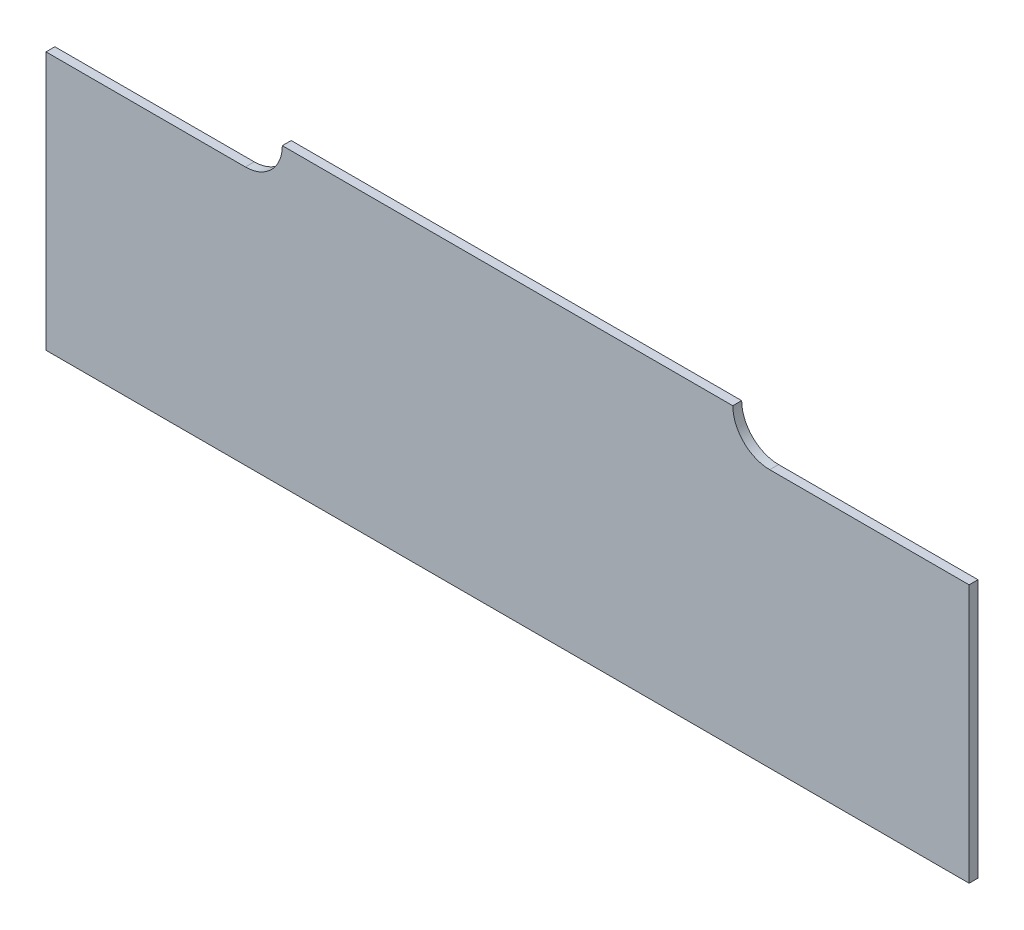
ISO-10303-21;
HEADER;
FILE_DESCRIPTION(('STEP AP214'),'2;1');
FILE_NAME('part.step','',(''),(''),'','','');
FILE_SCHEMA(('AUTOMOTIVE_DESIGN { 1 0 10303 214 1 1 1 1 }'));
ENDSEC;
DATA;
#1=APPLICATION_CONTEXT('core data for automotive mechanical design processes');
#2=APPLICATION_PROTOCOL_DEFINITION('international standard','automotive_design',2000,#1);
#3=PRODUCT_CONTEXT('',#1,'mechanical');
#4=PRODUCT('Part','Part','',(#3));
#5=PRODUCT_RELATED_PRODUCT_CATEGORY('part','',(#4));
#6=PRODUCT_DEFINITION_FORMATION('','',#4);
#7=PRODUCT_DEFINITION_CONTEXT('part definition',#1,'design');
#8=PRODUCT_DEFINITION('design','',#6,#7);
#9=PRODUCT_DEFINITION_SHAPE('','',#8);
#10=(LENGTH_UNIT() NAMED_UNIT(*) SI_UNIT(.MILLI.,.METRE.));
#11=(NAMED_UNIT(*) PLANE_ANGLE_UNIT() SI_UNIT($,.RADIAN.));
#12=(NAMED_UNIT(*) SI_UNIT($,.STERADIAN.) SOLID_ANGLE_UNIT());
#13=UNCERTAINTY_MEASURE_WITH_UNIT(LENGTH_MEASURE(1.E-05),#10,'distance_accuracy_value','');
#14=(GEOMETRIC_REPRESENTATION_CONTEXT(3) GLOBAL_UNCERTAINTY_ASSIGNED_CONTEXT((#13)) GLOBAL_UNIT_ASSIGNED_CONTEXT((#10,
#11,#12)) REPRESENTATION_CONTEXT('',''));
#15=CARTESIAN_POINT('',(0.,0.,0.));
#16=DIRECTION('',(0.,0.,1.));
#17=DIRECTION('',(1.,0.,0.));
#18=AXIS2_PLACEMENT_3D('',#15,#16,#17);
#19=CARTESIAN_POINT('',(12.5,0.,0.));
#20=DIRECTION('',(1.,0.,0.));
#21=DIRECTION('',(0.,0.,-1.));
#22=AXIS2_PLACEMENT_3D('',#19,#20,#21);
#23=PLANE('',#22);
#24=DIRECTION('',(0.,1.,0.));
#25=VECTOR('',#24,1.);
#26=CARTESIAN_POINT('',(12.5,0.,0.12));
#27=LINE('',#26,#25);
#28=CARTESIAN_POINT('',(12.5,0.,0.12));
#29=VERTEX_POINT('',#28);
#30=CARTESIAN_POINT('',(12.5,3.5,0.12));
#31=VERTEX_POINT('',#30);
#32=EDGE_CURVE('E153',#29,#31,#27,.T.);
#33=ORIENTED_EDGE('',*,*,#32,.F.);
#34=DIRECTION('',(0.,0.,1.));
#35=VECTOR('',#34,1.);
#36=CARTESIAN_POINT('',(12.5,0.,0.));
#37=LINE('',#36,#35);
#38=CARTESIAN_POINT('',(12.5,0.,0.));
#39=VERTEX_POINT('',#38);
#40=EDGE_CURVE('E11',#39,#29,#37,.T.);
#41=ORIENTED_EDGE('',*,*,#40,.F.);
#42=DIRECTION('',(0.,1.,0.));
#43=VECTOR('',#42,1.);
#44=CARTESIAN_POINT('',(12.5,0.,0.));
#45=LINE('',#44,#43);
#46=CARTESIAN_POINT('',(12.5,3.5,0.));
#47=VERTEX_POINT('',#46);
#48=EDGE_CURVE('E133',#39,#47,#45,.T.);
#49=ORIENTED_EDGE('',*,*,#48,.T.);
#50=DIRECTION('',(0.,0.,1.));
#51=VECTOR('',#50,1.);
#52=CARTESIAN_POINT('',(12.5,3.5,0.));
#53=LINE('',#52,#51);
#54=EDGE_CURVE('E38',#47,#31,#53,.T.);
#55=ORIENTED_EDGE('',*,*,#54,.T.);
#56=EDGE_LOOP('',(#33,#41,#49,#55));
#57=FACE_BOUND('',#56,.T.);
#58=ADVANCED_FACE('F35',(#57),#23,.T.);
#59=CARTESIAN_POINT('',(0.,0.,0.));
#60=DIRECTION('',(0.,-1.,0.));
#61=DIRECTION('',(0.,0.,-1.));
#62=AXIS2_PLACEMENT_3D('',#59,#60,#61);
#63=PLANE('',#62);
#64=DIRECTION('',(1.,0.,0.));
#65=VECTOR('',#64,1.);
#66=CARTESIAN_POINT('',(0.,0.,0.12));
#67=LINE('',#66,#65);
#68=CARTESIAN_POINT('',(0.,0.,0.12));
#69=VERTEX_POINT('',#68);
#70=EDGE_CURVE('E135',#69,#29,#67,.T.);
#71=ORIENTED_EDGE('',*,*,#70,.F.);
#72=DIRECTION('',(0.,0.,1.));
#73=VECTOR('',#72,1.);
#74=CARTESIAN_POINT('',(0.,0.,0.));
#75=LINE('',#74,#73);
#76=CARTESIAN_POINT('',(0.,0.,0.));
#77=VERTEX_POINT('',#76);
#78=EDGE_CURVE('E44',#77,#69,#75,.T.);
#79=ORIENTED_EDGE('',*,*,#78,.F.);
#80=DIRECTION('',(1.,0.,0.));
#81=VECTOR('',#80,1.);
#82=CARTESIAN_POINT('',(0.,0.,0.));
#83=LINE('',#82,#81);
#84=EDGE_CURVE('E122',#77,#39,#83,.T.);
#85=ORIENTED_EDGE('',*,*,#84,.T.);
#86=ORIENTED_EDGE('',*,*,#40,.T.);
#87=EDGE_LOOP('',(#71,#79,#85,#86));
#88=FACE_BOUND('',#87,.T.);
#89=ADVANCED_FACE('F168',(#88),#63,.T.);
#90=CARTESIAN_POINT('',(0.,0.,0.));
#91=DIRECTION('',(-1.,0.,0.));
#92=DIRECTION('',(0.,0.,1.));
#93=AXIS2_PLACEMENT_3D('',#90,#91,#92);
#94=PLANE('',#93);
#95=DIRECTION('',(0.,-1.,0.));
#96=VECTOR('',#95,1.);
#97=CARTESIAN_POINT('',(0.,0.,0.12));
#98=LINE('',#97,#96);
#99=CARTESIAN_POINT('',(0.,3.5,0.12));
#100=VERTEX_POINT('',#99);
#101=EDGE_CURVE('E109',#100,#69,#98,.T.);
#102=ORIENTED_EDGE('',*,*,#101,.F.);
#103=DIRECTION('',(0.,0.,1.));
#104=VECTOR('',#103,1.);
#105=CARTESIAN_POINT('',(0.,3.5,0.));
#106=LINE('',#105,#104);
#107=CARTESIAN_POINT('',(0.,3.5,0.));
#108=VERTEX_POINT('',#107);
#109=EDGE_CURVE('E104',#108,#100,#106,.T.);
#110=ORIENTED_EDGE('',*,*,#109,.F.);
#111=DIRECTION('',(0.,-1.,0.));
#112=VECTOR('',#111,1.);
#113=CARTESIAN_POINT('',(0.,0.,0.));
#114=LINE('',#113,#112);
#115=EDGE_CURVE('E107',#108,#77,#114,.T.);
#116=ORIENTED_EDGE('',*,*,#115,.T.);
#117=ORIENTED_EDGE('',*,*,#78,.T.);
#118=EDGE_LOOP('',(#102,#110,#116,#117));
#119=FACE_BOUND('',#118,.T.);
#120=ADVANCED_FACE('F106',(#119),#94,.T.);
#121=CARTESIAN_POINT('',(0.,3.5,0.));
#122=DIRECTION('',(0.,1.,0.));
#123=DIRECTION('',(0.,0.,1.));
#124=AXIS2_PLACEMENT_3D('',#121,#122,#123);
#125=PLANE('',#124);
#126=DIRECTION('',(-1.,0.,0.));
#127=VECTOR('',#126,1.);
#128=CARTESIAN_POINT('',(0.,3.5,0.12));
#129=LINE('',#128,#127);
#130=CARTESIAN_POINT('',(2.7,3.5,0.12));
#131=VERTEX_POINT('',#130);
#132=EDGE_CURVE('E140',#131,#100,#129,.T.);
#133=ORIENTED_EDGE('',*,*,#132,.F.);
#134=DIRECTION('',(0.,0.,1.));
#135=VECTOR('',#134,1.);
#136=CARTESIAN_POINT('',(2.7,3.5,0.));
#137=LINE('',#136,#135);
#138=CARTESIAN_POINT('',(2.7,3.5,0.));
#139=VERTEX_POINT('',#138);
#140=EDGE_CURVE('E114',#139,#131,#137,.T.);
#141=ORIENTED_EDGE('',*,*,#140,.F.);
#142=DIRECTION('',(-1.,0.,0.));
#143=VECTOR('',#142,1.);
#144=CARTESIAN_POINT('',(0.,3.5,0.));
#145=LINE('',#144,#143);
#146=EDGE_CURVE('E120',#139,#108,#145,.T.);
#147=ORIENTED_EDGE('',*,*,#146,.T.);
#148=ORIENTED_EDGE('',*,*,#109,.T.);
#149=EDGE_LOOP('',(#133,#141,#147,#148));
#150=FACE_BOUND('',#149,.T.);
#151=ADVANCED_FACE('F124',(#150),#125,.T.);
#152=CARTESIAN_POINT('',(2.7,4.,0.));
#153=DIRECTION('',(0.,0.,1.));
#154=DIRECTION('',(1.,0.,0.));
#155=AXIS2_PLACEMENT_3D('',#152,#153,#154);
#156=CYLINDRICAL_SURFACE('',#155,0.5);
#157=CARTESIAN_POINT('',(2.7,4.,0.12));
#158=DIRECTION('',(0.,0.,1.));
#159=DIRECTION('',(1.,0.,0.));
#160=AXIS2_PLACEMENT_3D('',#157,#158,#159);
#161=CIRCLE('',#160,0.5);
#162=CARTESIAN_POINT('',(3.2,4.,0.12));
#163=VERTEX_POINT('',#162);
#164=EDGE_CURVE('E163',#163,#131,#161,.F.);
#165=ORIENTED_EDGE('',*,*,#164,.F.);
#166=DIRECTION('',(0.,0.,1.));
#167=VECTOR('',#166,1.);
#168=CARTESIAN_POINT('',(3.2,4.,0.));
#169=LINE('',#168,#167);
#170=CARTESIAN_POINT('',(3.2,4.,0.));
#171=VERTEX_POINT('',#170);
#172=EDGE_CURVE('E146',#171,#163,#169,.T.);
#173=ORIENTED_EDGE('',*,*,#172,.F.);
#174=CARTESIAN_POINT('',(2.7,4.,0.));
#175=DIRECTION('',(0.,0.,1.));
#176=DIRECTION('',(1.,0.,0.));
#177=AXIS2_PLACEMENT_3D('',#174,#175,#176);
#178=CIRCLE('',#177,0.5);
#179=EDGE_CURVE('E125',#171,#139,#178,.F.);
#180=ORIENTED_EDGE('',*,*,#179,.T.);
#181=ORIENTED_EDGE('',*,*,#140,.T.);
#182=EDGE_LOOP('',(#165,#173,#180,#181));
#183=FACE_BOUND('',#182,.T.);
#184=ADVANCED_FACE('F181',(#183),#156,.F.);
#185=CARTESIAN_POINT('',(0.,4.,0.));
#186=DIRECTION('',(0.,-1.,0.));
#187=DIRECTION('',(0.,0.,-1.));
#188=AXIS2_PLACEMENT_3D('',#185,#186,#187);
#189=PLANE('',#188);
#190=DIRECTION('',(1.,0.,0.));
#191=VECTOR('',#190,1.);
#192=CARTESIAN_POINT('',(0.,4.,0.12));
#193=LINE('',#192,#191);
#194=CARTESIAN_POINT('',(9.3,4.,0.12));
#195=VERTEX_POINT('',#194);
#196=EDGE_CURVE('E161',#163,#195,#193,.T.);
#197=ORIENTED_EDGE('',*,*,#196,.T.);
#198=DIRECTION('',(0.,0.,1.));
#199=VECTOR('',#198,1.);
#200=CARTESIAN_POINT('',(9.3,4.,0.));
#201=LINE('',#200,#199);
#202=CARTESIAN_POINT('',(9.3,4.,0.));
#203=VERTEX_POINT('',#202);
#204=EDGE_CURVE('E148',#203,#195,#201,.T.);
#205=ORIENTED_EDGE('',*,*,#204,.F.);
#206=DIRECTION('',(1.,0.,0.));
#207=VECTOR('',#206,1.);
#208=CARTESIAN_POINT('',(0.,4.,0.));
#209=LINE('',#208,#207);
#210=EDGE_CURVE('E128',#171,#203,#209,.T.);
#211=ORIENTED_EDGE('',*,*,#210,.F.);
#212=ORIENTED_EDGE('',*,*,#172,.T.);
#213=EDGE_LOOP('',(#197,#205,#211,#212));
#214=FACE_BOUND('',#213,.T.);
#215=ADVANCED_FACE('F185',(#214),#189,.F.);
#216=CARTESIAN_POINT('',(9.8,4.,0.));
#217=DIRECTION('',(0.,0.,1.));
#218=DIRECTION('',(1.,0.,0.));
#219=AXIS2_PLACEMENT_3D('',#216,#217,#218);
#220=CYLINDRICAL_SURFACE('',#219,0.5);
#221=CARTESIAN_POINT('',(9.8,4.,0.12));
#222=DIRECTION('',(0.,0.,1.));
#223=DIRECTION('',(1.,0.,0.));
#224=AXIS2_PLACEMENT_3D('',#221,#222,#223);
#225=CIRCLE('',#224,0.5);
#226=CARTESIAN_POINT('',(9.8,3.5,0.12));
#227=VERTEX_POINT('',#226);
#228=EDGE_CURVE('E158',#227,#195,#225,.F.);
#229=ORIENTED_EDGE('',*,*,#228,.F.);
#230=DIRECTION('',(0.,0.,1.));
#231=VECTOR('',#230,1.);
#232=CARTESIAN_POINT('',(9.8,3.5,0.));
#233=LINE('',#232,#231);
#234=CARTESIAN_POINT('',(9.8,3.5,0.));
#235=VERTEX_POINT('',#234);
#236=EDGE_CURVE('E149',#235,#227,#233,.T.);
#237=ORIENTED_EDGE('',*,*,#236,.F.);
#238=CARTESIAN_POINT('',(9.8,4.,0.));
#239=DIRECTION('',(0.,0.,1.));
#240=DIRECTION('',(1.,0.,0.));
#241=AXIS2_PLACEMENT_3D('',#238,#239,#240);
#242=CIRCLE('',#241,0.5);
#243=EDGE_CURVE('E132',#235,#203,#242,.F.);
#244=ORIENTED_EDGE('',*,*,#243,.T.);
#245=ORIENTED_EDGE('',*,*,#204,.T.);
#246=EDGE_LOOP('',(#229,#237,#244,#245));
#247=FACE_BOUND('',#246,.T.);
#248=ADVANCED_FACE('F188',(#247),#220,.F.);
#249=EDGE_CURVE('E155',#31,#227,#129,.T.);
#250=ORIENTED_EDGE('',*,*,#249,.F.);
#251=ORIENTED_EDGE('',*,*,#54,.F.);
#252=EDGE_CURVE('E127',#47,#235,#145,.T.);
#253=ORIENTED_EDGE('',*,*,#252,.T.);
#254=ORIENTED_EDGE('',*,*,#236,.T.);
#255=EDGE_LOOP('',(#250,#251,#253,#254));
#256=FACE_BOUND('',#255,.T.);
#257=ADVANCED_FACE('F182',(#256),#125,.T.);
#258=CARTESIAN_POINT('',(0.,0.,0.));
#259=DIRECTION('',(0.,0.,1.));
#260=DIRECTION('',(1.,0.,0.));
#261=AXIS2_PLACEMENT_3D('',#258,#259,#260);
#262=PLANE('',#261);
#263=ORIENTED_EDGE('',*,*,#48,.F.);
#264=ORIENTED_EDGE('',*,*,#84,.F.);
#265=ORIENTED_EDGE('',*,*,#115,.F.);
#266=ORIENTED_EDGE('',*,*,#146,.F.);
#267=ORIENTED_EDGE('',*,*,#179,.F.);
#268=ORIENTED_EDGE('',*,*,#210,.T.);
#269=ORIENTED_EDGE('',*,*,#243,.F.);
#270=ORIENTED_EDGE('',*,*,#252,.F.);
#271=EDGE_LOOP('',(#263,#264,#265,#266,#267,#268,#269,#270));
#272=FACE_BOUND('',#271,.T.);
#273=ADVANCED_FACE('F118',(#272),#262,.F.);
#274=CARTESIAN_POINT('',(0.,0.,0.12));
#275=DIRECTION('',(0.,0.,1.));
#276=DIRECTION('',(1.,0.,0.));
#277=AXIS2_PLACEMENT_3D('',#274,#275,#276);
#278=PLANE('',#277);
#279=ORIENTED_EDGE('',*,*,#32,.T.);
#280=ORIENTED_EDGE('',*,*,#249,.T.);
#281=ORIENTED_EDGE('',*,*,#228,.T.);
#282=ORIENTED_EDGE('',*,*,#196,.F.);
#283=ORIENTED_EDGE('',*,*,#164,.T.);
#284=ORIENTED_EDGE('',*,*,#132,.T.);
#285=ORIENTED_EDGE('',*,*,#101,.T.);
#286=ORIENTED_EDGE('',*,*,#70,.T.);
#287=EDGE_LOOP('',(#279,#280,#281,#282,#283,#284,#285,#286));
#288=FACE_BOUND('',#287,.T.);
#289=ADVANCED_FACE('F167',(#288),#278,.T.);
#290=CLOSED_SHELL('',(#58,#89,#120,#151,#184,#215,#248,#257,#273,#289));
#291=MANIFOLD_SOLID_BREP('B2',#290);
#292=ADVANCED_BREP_SHAPE_REPRESENTATION('',(#18,#291),#14);
#293=SHAPE_DEFINITION_REPRESENTATION(#9,#292);
ENDSEC;
END-ISO-10303-21;
